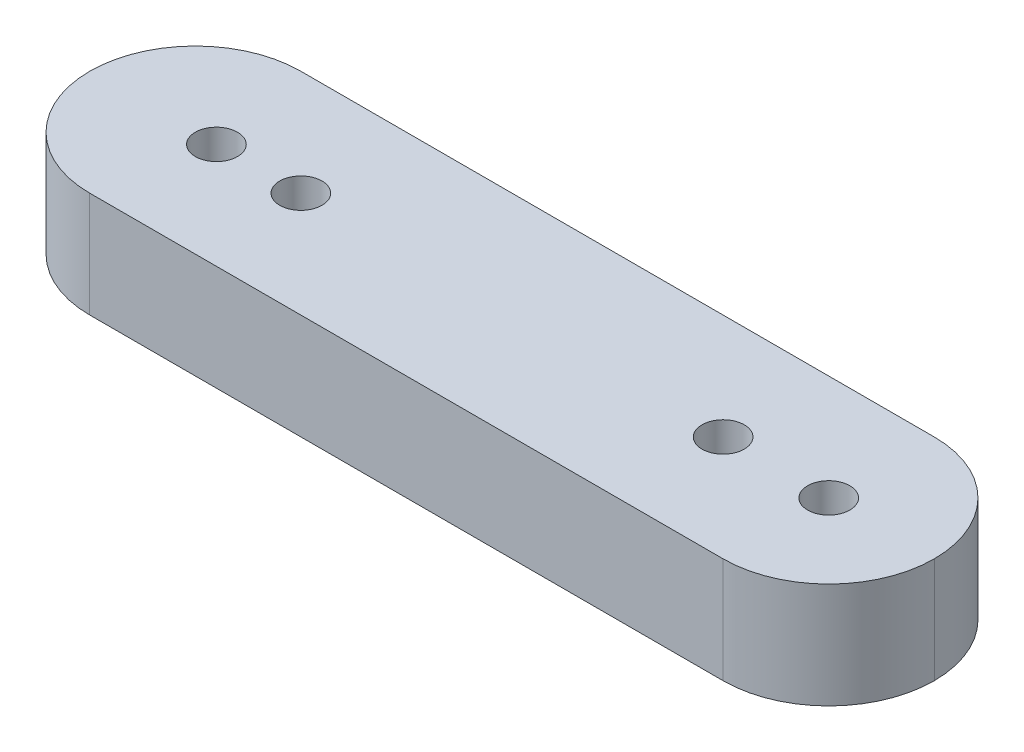
ISO-10303-21;
HEADER;
FILE_DESCRIPTION(('STEP AP214'),'2;1');
FILE_NAME('part.step','',(''),(''),'','','');
FILE_SCHEMA(('AUTOMOTIVE_DESIGN { 1 0 10303 214 1 1 1 1 }'));
ENDSEC;
DATA;
#1=APPLICATION_CONTEXT('core data for automotive mechanical design processes');
#2=APPLICATION_PROTOCOL_DEFINITION('international standard','automotive_design',2000,#1);
#3=PRODUCT_CONTEXT('',#1,'mechanical');
#4=PRODUCT('Part','Part','',(#3));
#5=PRODUCT_RELATED_PRODUCT_CATEGORY('part','',(#4));
#6=PRODUCT_DEFINITION_FORMATION('','',#4);
#7=PRODUCT_DEFINITION_CONTEXT('part definition',#1,'design');
#8=PRODUCT_DEFINITION('design','',#6,#7);
#9=PRODUCT_DEFINITION_SHAPE('','',#8);
#10=(LENGTH_UNIT() NAMED_UNIT(*) SI_UNIT(.MILLI.,.METRE.));
#11=(NAMED_UNIT(*) PLANE_ANGLE_UNIT() SI_UNIT($,.RADIAN.));
#12=(NAMED_UNIT(*) SI_UNIT($,.STERADIAN.) SOLID_ANGLE_UNIT());
#13=UNCERTAINTY_MEASURE_WITH_UNIT(LENGTH_MEASURE(1.E-05),#10,'distance_accuracy_value','');
#14=(GEOMETRIC_REPRESENTATION_CONTEXT(3) GLOBAL_UNCERTAINTY_ASSIGNED_CONTEXT((#13)) GLOBAL_UNIT_ASSIGNED_CONTEXT((#10,
#11,#12)) REPRESENTATION_CONTEXT('',''));
#15=CARTESIAN_POINT('',(0.,0.,0.));
#16=DIRECTION('',(0.,0.,1.));
#17=DIRECTION('',(1.,0.,0.));
#18=AXIS2_PLACEMENT_3D('',#15,#16,#17);
#19=CARTESIAN_POINT('',(-20.,5.,-5.));
#20=DIRECTION('',(0.,0.,1.));
#21=DIRECTION('',(1.,0.,0.));
#22=AXIS2_PLACEMENT_3D('',#19,#20,#21);
#23=PLANE('',#22);
#24=DIRECTION('',(-1.,0.,0.));
#25=VECTOR('',#24,1.);
#26=CARTESIAN_POINT('',(-20.,5.,-5.));
#27=LINE('',#26,#25);
#28=CARTESIAN_POINT('',(15.,5.,-5.));
#29=VERTEX_POINT('',#28);
#30=CARTESIAN_POINT('',(-15.,5.,-5.));
#31=VERTEX_POINT('',#30);
#32=EDGE_CURVE('E106',#29,#31,#27,.T.);
#33=ORIENTED_EDGE('',*,*,#32,.F.);
#34=DIRECTION('',(0.,-1.,0.));
#35=VECTOR('',#34,1.);
#36=CARTESIAN_POINT('',(15.,5.,-5.));
#37=LINE('',#36,#35);
#38=CARTESIAN_POINT('',(15.,0.,-5.));
#39=VERTEX_POINT('',#38);
#40=EDGE_CURVE('E91',#29,#39,#37,.T.);
#41=ORIENTED_EDGE('',*,*,#40,.T.);
#42=DIRECTION('',(-1.,0.,0.));
#43=VECTOR('',#42,1.);
#44=CARTESIAN_POINT('',(-20.,0.,-5.));
#45=LINE('',#44,#43);
#46=CARTESIAN_POINT('',(-15.,0.,-5.));
#47=VERTEX_POINT('',#46);
#48=EDGE_CURVE('E103',#39,#47,#45,.T.);
#49=ORIENTED_EDGE('',*,*,#48,.T.);
#50=DIRECTION('',(0.,-1.,0.));
#51=VECTOR('',#50,1.);
#52=CARTESIAN_POINT('',(-15.,5.,-5.));
#53=LINE('',#52,#51);
#54=EDGE_CURVE('E108',#47,#31,#53,.F.);
#55=ORIENTED_EDGE('',*,*,#54,.T.);
#56=EDGE_LOOP('',(#33,#41,#49,#55));
#57=FACE_BOUND('',#56,.T.);
#58=ADVANCED_FACE('F33',(#57),#23,.F.);
#59=CARTESIAN_POINT('',(-20.,5.,5.));
#60=DIRECTION('',(0.,0.,-1.));
#61=DIRECTION('',(-1.,0.,0.));
#62=AXIS2_PLACEMENT_3D('',#59,#60,#61);
#63=PLANE('',#62);
#64=DIRECTION('',(1.,0.,0.));
#65=VECTOR('',#64,1.);
#66=CARTESIAN_POINT('',(-20.,0.,5.));
#67=LINE('',#66,#65);
#68=CARTESIAN_POINT('',(-15.,0.,5.));
#69=VERTEX_POINT('',#68);
#70=CARTESIAN_POINT('',(15.,0.,5.));
#71=VERTEX_POINT('',#70);
#72=EDGE_CURVE('E113',#69,#71,#67,.T.);
#73=ORIENTED_EDGE('',*,*,#72,.T.);
#74=DIRECTION('',(0.,-1.,0.));
#75=VECTOR('',#74,1.);
#76=CARTESIAN_POINT('',(15.,5.,5.));
#77=LINE('',#76,#75);
#78=CARTESIAN_POINT('',(15.,5.,5.));
#79=VERTEX_POINT('',#78);
#80=EDGE_CURVE('E11',#71,#79,#77,.F.);
#81=ORIENTED_EDGE('',*,*,#80,.T.);
#82=DIRECTION('',(1.,0.,0.));
#83=VECTOR('',#82,1.);
#84=CARTESIAN_POINT('',(-20.,5.,5.));
#85=LINE('',#84,#83);
#86=CARTESIAN_POINT('',(-15.,5.,5.));
#87=VERTEX_POINT('',#86);
#88=EDGE_CURVE('E121',#87,#79,#85,.T.);
#89=ORIENTED_EDGE('',*,*,#88,.F.);
#90=DIRECTION('',(0.,-1.,0.));
#91=VECTOR('',#90,1.);
#92=CARTESIAN_POINT('',(-15.,5.,5.));
#93=LINE('',#92,#91);
#94=EDGE_CURVE('E42',#87,#69,#93,.T.);
#95=ORIENTED_EDGE('',*,*,#94,.T.);
#96=EDGE_LOOP('',(#73,#81,#89,#95));
#97=FACE_BOUND('',#96,.T.);
#98=ADVANCED_FACE('F147',(#97),#63,.F.);
#99=CARTESIAN_POINT('',(0.,5.,0.));
#100=DIRECTION('',(0.,-1.,0.));
#101=DIRECTION('',(0.,0.,-1.));
#102=AXIS2_PLACEMENT_3D('',#99,#100,#101);
#103=PLANE('',#102);
#104=CARTESIAN_POINT('',(15.,5.,0.));
#105=DIRECTION('',(0.,1.,0.));
#106=DIRECTION('',(0.,0.,1.));
#107=AXIS2_PLACEMENT_3D('',#104,#105,#106);
#108=CIRCLE('',#107,1.);
#109=CARTESIAN_POINT('',(15.,5.,1.));
#110=VERTEX_POINT('',#109);
#111=EDGE_CURVE('E154',#110,#110,#108,.T.);
#112=ORIENTED_EDGE('',*,*,#111,.F.);
#113=EDGE_LOOP('',(#112));
#114=FACE_BOUND('',#113,.T.);
#115=CARTESIAN_POINT('',(-10.,5.,0.));
#116=DIRECTION('',(0.,1.,0.));
#117=DIRECTION('',(0.,0.,1.));
#118=AXIS2_PLACEMENT_3D('',#115,#116,#117);
#119=CIRCLE('',#118,1.);
#120=CARTESIAN_POINT('',(-10.,5.,1.));
#121=VERTEX_POINT('',#120);
#122=EDGE_CURVE('E161',#121,#121,#119,.T.);
#123=ORIENTED_EDGE('',*,*,#122,.F.);
#124=EDGE_LOOP('',(#123));
#125=FACE_BOUND('',#124,.T.);
#126=CARTESIAN_POINT('',(-14.,5.,0.));
#127=DIRECTION('',(0.,1.,0.));
#128=DIRECTION('',(0.,0.,1.));
#129=AXIS2_PLACEMENT_3D('',#126,#127,#128);
#130=CIRCLE('',#129,1.);
#131=CARTESIAN_POINT('',(-14.,5.,1.));
#132=VERTEX_POINT('',#131);
#133=EDGE_CURVE('E137',#132,#132,#130,.T.);
#134=ORIENTED_EDGE('',*,*,#133,.F.);
#135=EDGE_LOOP('',(#134));
#136=FACE_BOUND('',#135,.T.);
#137=CARTESIAN_POINT('',(10.,5.,0.));
#138=DIRECTION('',(0.,1.,0.));
#139=DIRECTION('',(0.,0.,1.));
#140=AXIS2_PLACEMENT_3D('',#137,#138,#139);
#141=CIRCLE('',#140,1.);
#142=CARTESIAN_POINT('',(10.,5.,1.));
#143=VERTEX_POINT('',#142);
#144=EDGE_CURVE('E114',#143,#143,#141,.T.);
#145=ORIENTED_EDGE('',*,*,#144,.F.);
#146=EDGE_LOOP('',(#145));
#147=FACE_BOUND('',#146,.T.);
#148=CARTESIAN_POINT('',(15.,5.,0.));
#149=DIRECTION('',(0.,-1.,0.));
#150=DIRECTION('',(0.,0.,-1.));
#151=AXIS2_PLACEMENT_3D('',#148,#149,#150);
#152=CIRCLE('',#151,5.);
#153=CARTESIAN_POINT('',(20.,5.,0.));
#154=VERTEX_POINT('',#153);
#155=EDGE_CURVE('E131',#79,#154,#152,.F.);
#156=ORIENTED_EDGE('',*,*,#155,.T.);
#157=CARTESIAN_POINT('',(15.,5.,0.));
#158=DIRECTION('',(0.,-1.,0.));
#159=DIRECTION('',(0.,0.,-1.));
#160=AXIS2_PLACEMENT_3D('',#157,#158,#159);
#161=CIRCLE('',#160,5.);
#162=EDGE_CURVE('E133',#154,#29,#161,.F.);
#163=ORIENTED_EDGE('',*,*,#162,.T.);
#164=ORIENTED_EDGE('',*,*,#32,.T.);
#165=CARTESIAN_POINT('',(-15.,5.,0.));
#166=DIRECTION('',(0.,-1.,0.));
#167=DIRECTION('',(0.,0.,-1.));
#168=AXIS2_PLACEMENT_3D('',#165,#166,#167);
#169=CIRCLE('',#168,5.);
#170=CARTESIAN_POINT('',(-20.,5.,0.));
#171=VERTEX_POINT('',#170);
#172=EDGE_CURVE('E129',#31,#171,#169,.F.);
#173=ORIENTED_EDGE('',*,*,#172,.T.);
#174=CARTESIAN_POINT('',(-15.,5.,0.));
#175=DIRECTION('',(0.,-1.,0.));
#176=DIRECTION('',(0.,0.,-1.));
#177=AXIS2_PLACEMENT_3D('',#174,#175,#176);
#178=CIRCLE('',#177,5.);
#179=EDGE_CURVE('E55',#171,#87,#178,.F.);
#180=ORIENTED_EDGE('',*,*,#179,.T.);
#181=ORIENTED_EDGE('',*,*,#88,.T.);
#182=EDGE_LOOP('',(#156,#163,#164,#173,#180,#181));
#183=FACE_BOUND('',#182,.T.);
#184=ADVANCED_FACE('F151',(#114,#125,#136,#147,#183),#103,.F.);
#185=CARTESIAN_POINT('',(0.,0.,0.));
#186=DIRECTION('',(0.,-1.,0.));
#187=DIRECTION('',(0.,0.,-1.));
#188=AXIS2_PLACEMENT_3D('',#185,#186,#187);
#189=PLANE('',#188);
#190=CARTESIAN_POINT('',(15.,0.,0.));
#191=DIRECTION('',(0.,1.,0.));
#192=DIRECTION('',(0.,0.,1.));
#193=AXIS2_PLACEMENT_3D('',#190,#191,#192);
#194=CIRCLE('',#193,1.);
#195=CARTESIAN_POINT('',(15.,0.,1.));
#196=VERTEX_POINT('',#195);
#197=EDGE_CURVE('E164',#196,#196,#194,.T.);
#198=ORIENTED_EDGE('',*,*,#197,.T.);
#199=EDGE_LOOP('',(#198));
#200=FACE_BOUND('',#199,.T.);
#201=CARTESIAN_POINT('',(-10.,0.,0.));
#202=DIRECTION('',(0.,1.,0.));
#203=DIRECTION('',(0.,0.,1.));
#204=AXIS2_PLACEMENT_3D('',#201,#202,#203);
#205=CIRCLE('',#204,1.);
#206=CARTESIAN_POINT('',(-10.,0.,1.));
#207=VERTEX_POINT('',#206);
#208=EDGE_CURVE('E158',#207,#207,#205,.T.);
#209=ORIENTED_EDGE('',*,*,#208,.T.);
#210=EDGE_LOOP('',(#209));
#211=FACE_BOUND('',#210,.T.);
#212=CARTESIAN_POINT('',(-14.,0.,0.));
#213=DIRECTION('',(0.,1.,0.));
#214=DIRECTION('',(0.,0.,1.));
#215=AXIS2_PLACEMENT_3D('',#212,#213,#214);
#216=CIRCLE('',#215,1.);
#217=CARTESIAN_POINT('',(-14.,0.,1.));
#218=VERTEX_POINT('',#217);
#219=EDGE_CURVE('E135',#218,#218,#216,.T.);
#220=ORIENTED_EDGE('',*,*,#219,.T.);
#221=EDGE_LOOP('',(#220));
#222=FACE_BOUND('',#221,.T.);
#223=CARTESIAN_POINT('',(10.,0.,0.));
#224=DIRECTION('',(0.,1.,0.));
#225=DIRECTION('',(0.,0.,1.));
#226=AXIS2_PLACEMENT_3D('',#223,#224,#225);
#227=CIRCLE('',#226,1.);
#228=CARTESIAN_POINT('',(10.,0.,1.));
#229=VERTEX_POINT('',#228);
#230=EDGE_CURVE('E118',#229,#229,#227,.T.);
#231=ORIENTED_EDGE('',*,*,#230,.T.);
#232=EDGE_LOOP('',(#231));
#233=FACE_BOUND('',#232,.T.);
#234=ORIENTED_EDGE('',*,*,#48,.F.);
#235=CARTESIAN_POINT('',(15.,0.,0.));
#236=DIRECTION('',(0.,-1.,0.));
#237=DIRECTION('',(0.,0.,-1.));
#238=AXIS2_PLACEMENT_3D('',#235,#236,#237);
#239=CIRCLE('',#238,5.);
#240=CARTESIAN_POINT('',(20.,0.,0.));
#241=VERTEX_POINT('',#240);
#242=EDGE_CURVE('E87',#39,#241,#239,.T.);
#243=ORIENTED_EDGE('',*,*,#242,.T.);
#244=CARTESIAN_POINT('',(15.,0.,0.));
#245=DIRECTION('',(0.,-1.,0.));
#246=DIRECTION('',(0.,0.,-1.));
#247=AXIS2_PLACEMENT_3D('',#244,#245,#246);
#248=CIRCLE('',#247,5.);
#249=EDGE_CURVE('E97',#241,#71,#248,.T.);
#250=ORIENTED_EDGE('',*,*,#249,.T.);
#251=ORIENTED_EDGE('',*,*,#72,.F.);
#252=CARTESIAN_POINT('',(-15.,0.,0.));
#253=DIRECTION('',(0.,-1.,0.));
#254=DIRECTION('',(0.,0.,-1.));
#255=AXIS2_PLACEMENT_3D('',#252,#253,#254);
#256=CIRCLE('',#255,5.);
#257=CARTESIAN_POINT('',(-20.,0.,0.));
#258=VERTEX_POINT('',#257);
#259=EDGE_CURVE('E107',#69,#258,#256,.T.);
#260=ORIENTED_EDGE('',*,*,#259,.T.);
#261=CARTESIAN_POINT('',(-15.,0.,0.));
#262=DIRECTION('',(0.,-1.,0.));
#263=DIRECTION('',(0.,0.,-1.));
#264=AXIS2_PLACEMENT_3D('',#261,#262,#263);
#265=CIRCLE('',#264,5.);
#266=EDGE_CURVE('E112',#258,#47,#265,.T.);
#267=ORIENTED_EDGE('',*,*,#266,.T.);
#268=EDGE_LOOP('',(#234,#243,#250,#251,#260,#267));
#269=FACE_BOUND('',#268,.T.);
#270=ADVANCED_FACE('F110',(#200,#211,#222,#233,#269),#189,.T.);
#271=CARTESIAN_POINT('',(10.,5.,0.));
#272=DIRECTION('',(0.,-1.,0.));
#273=DIRECTION('',(0.,0.,-1.));
#274=AXIS2_PLACEMENT_3D('',#271,#272,#273);
#275=CYLINDRICAL_SURFACE('',#274,1.);
#276=ORIENTED_EDGE('',*,*,#144,.T.);
#277=EDGE_LOOP('',(#276));
#278=FACE_BOUND('',#277,.T.);
#279=ORIENTED_EDGE('',*,*,#230,.F.);
#280=EDGE_LOOP('',(#279));
#281=FACE_BOUND('',#280,.T.);
#282=ADVANCED_FACE('F182',(#278,#281),#275,.F.);
#283=CARTESIAN_POINT('',(-14.,5.,0.));
#284=DIRECTION('',(0.,-1.,0.));
#285=DIRECTION('',(0.,0.,-1.));
#286=AXIS2_PLACEMENT_3D('',#283,#284,#285);
#287=CYLINDRICAL_SURFACE('',#286,1.);
#288=ORIENTED_EDGE('',*,*,#133,.T.);
#289=EDGE_LOOP('',(#288));
#290=FACE_BOUND('',#289,.T.);
#291=ORIENTED_EDGE('',*,*,#219,.F.);
#292=EDGE_LOOP('',(#291));
#293=FACE_BOUND('',#292,.T.);
#294=ADVANCED_FACE('F185',(#290,#293),#287,.F.);
#295=CARTESIAN_POINT('',(-10.,5.,0.));
#296=DIRECTION('',(0.,-1.,0.));
#297=DIRECTION('',(0.,0.,-1.));
#298=AXIS2_PLACEMENT_3D('',#295,#296,#297);
#299=CYLINDRICAL_SURFACE('',#298,1.);
#300=ORIENTED_EDGE('',*,*,#122,.T.);
#301=EDGE_LOOP('',(#300));
#302=FACE_BOUND('',#301,.T.);
#303=ORIENTED_EDGE('',*,*,#208,.F.);
#304=EDGE_LOOP('',(#303));
#305=FACE_BOUND('',#304,.T.);
#306=ADVANCED_FACE('F225',(#302,#305),#299,.F.);
#307=CARTESIAN_POINT('',(15.,5.,0.));
#308=DIRECTION('',(0.,-1.,0.));
#309=DIRECTION('',(0.,0.,-1.));
#310=AXIS2_PLACEMENT_3D('',#307,#308,#309);
#311=CYLINDRICAL_SURFACE('',#310,1.);
#312=ORIENTED_EDGE('',*,*,#111,.T.);
#313=EDGE_LOOP('',(#312));
#314=FACE_BOUND('',#313,.T.);
#315=ORIENTED_EDGE('',*,*,#197,.F.);
#316=EDGE_LOOP('',(#315));
#317=FACE_BOUND('',#316,.T.);
#318=ADVANCED_FACE('F170',(#314,#317),#311,.F.);
#319=CARTESIAN_POINT('',(15.,5.,0.));
#320=DIRECTION('',(0.,-1.,0.));
#321=DIRECTION('',(0.,0.,-1.));
#322=AXIS2_PLACEMENT_3D('',#319,#320,#321);
#323=CYLINDRICAL_SURFACE('',#322,5.);
#324=DIRECTION('',(0.,-1.,0.));
#325=VECTOR('',#324,1.);
#326=CARTESIAN_POINT('',(20.,5.,0.));
#327=LINE('',#326,#325);
#328=EDGE_CURVE('E93',#154,#241,#327,.T.);
#329=ORIENTED_EDGE('',*,*,#328,.F.);
#330=ORIENTED_EDGE('',*,*,#155,.F.);
#331=ORIENTED_EDGE('',*,*,#80,.F.);
#332=ORIENTED_EDGE('',*,*,#249,.F.);
#333=EDGE_LOOP('',(#329,#330,#331,#332));
#334=FACE_BOUND('',#333,.T.);
#335=ADVANCED_FACE('F149',(#334),#323,.T.);
#336=CARTESIAN_POINT('',(15.,5.,0.));
#337=DIRECTION('',(0.,-1.,0.));
#338=DIRECTION('',(0.,0.,-1.));
#339=AXIS2_PLACEMENT_3D('',#336,#337,#338);
#340=CYLINDRICAL_SURFACE('',#339,5.);
#341=ORIENTED_EDGE('',*,*,#162,.F.);
#342=ORIENTED_EDGE('',*,*,#328,.T.);
#343=ORIENTED_EDGE('',*,*,#242,.F.);
#344=ORIENTED_EDGE('',*,*,#40,.F.);
#345=EDGE_LOOP('',(#341,#342,#343,#344));
#346=FACE_BOUND('',#345,.T.);
#347=ADVANCED_FACE('F90',(#346),#340,.T.);
#348=CARTESIAN_POINT('',(-15.,5.,0.));
#349=DIRECTION('',(0.,-1.,0.));
#350=DIRECTION('',(0.,0.,-1.));
#351=AXIS2_PLACEMENT_3D('',#348,#349,#350);
#352=CYLINDRICAL_SURFACE('',#351,5.);
#353=ORIENTED_EDGE('',*,*,#94,.F.);
#354=ORIENTED_EDGE('',*,*,#179,.F.);
#355=DIRECTION('',(0.,-1.,0.));
#356=VECTOR('',#355,1.);
#357=CARTESIAN_POINT('',(-20.,5.,0.));
#358=LINE('',#357,#356);
#359=EDGE_CURVE('E37',#258,#171,#358,.F.);
#360=ORIENTED_EDGE('',*,*,#359,.F.);
#361=ORIENTED_EDGE('',*,*,#259,.F.);
#362=EDGE_LOOP('',(#353,#354,#360,#361));
#363=FACE_BOUND('',#362,.T.);
#364=ADVANCED_FACE('F35',(#363),#352,.T.);
#365=CARTESIAN_POINT('',(-15.,5.,0.));
#366=DIRECTION('',(0.,-1.,0.));
#367=DIRECTION('',(0.,0.,-1.));
#368=AXIS2_PLACEMENT_3D('',#365,#366,#367);
#369=CYLINDRICAL_SURFACE('',#368,5.);
#370=ORIENTED_EDGE('',*,*,#172,.F.);
#371=ORIENTED_EDGE('',*,*,#54,.F.);
#372=ORIENTED_EDGE('',*,*,#266,.F.);
#373=ORIENTED_EDGE('',*,*,#359,.T.);
#374=EDGE_LOOP('',(#370,#371,#372,#373));
#375=FACE_BOUND('',#374,.T.);
#376=ADVANCED_FACE('F142',(#375),#369,.T.);
#377=CLOSED_SHELL('',(#58,#98,#184,#270,#282,#294,#306,#318,#335,#347,#364,#376));
#378=MANIFOLD_SOLID_BREP('B2',#377);
#379=ADVANCED_BREP_SHAPE_REPRESENTATION('',(#18,#378),#14);
#380=SHAPE_DEFINITION_REPRESENTATION(#9,#379);
ENDSEC;
END-ISO-10303-21;
